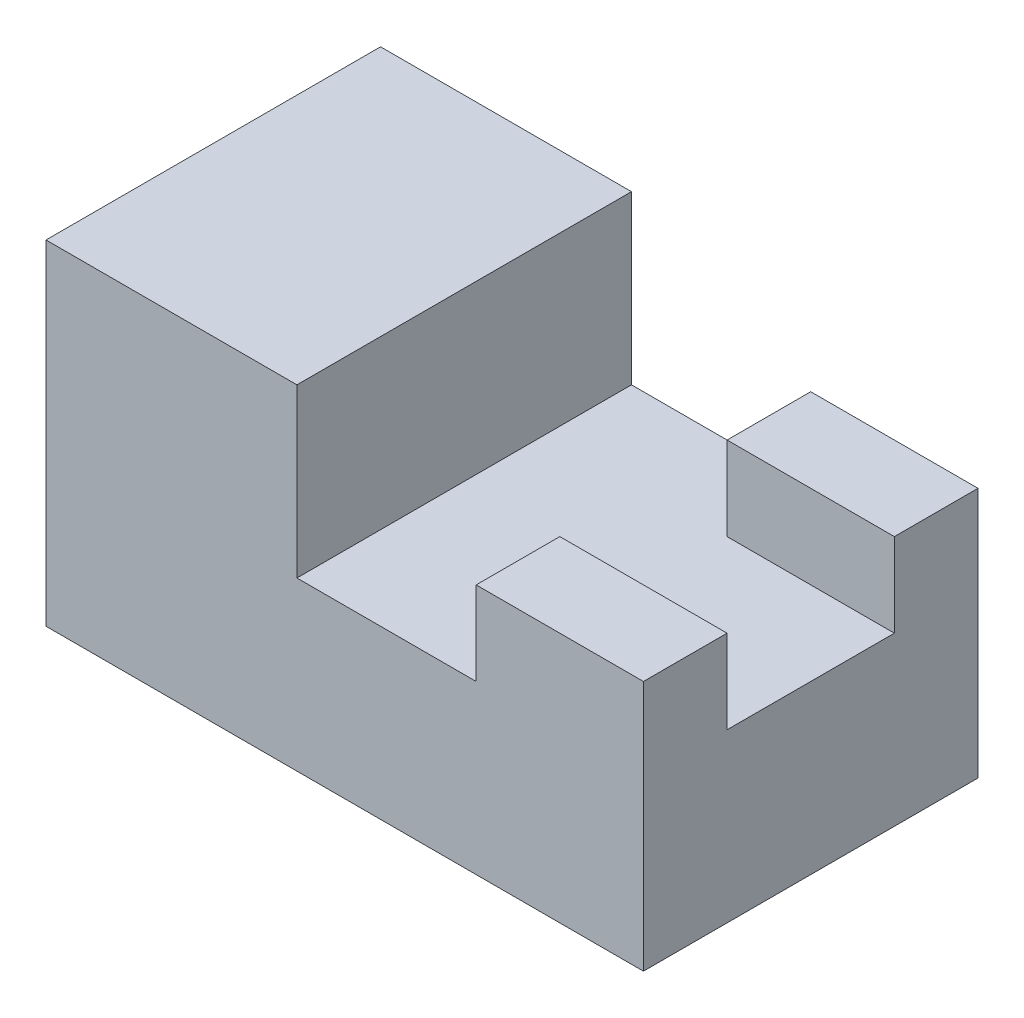
ISO-10303-21;
HEADER;
FILE_DESCRIPTION(('STEP AP214'),'2;1');
FILE_NAME('part.step','',(''),(''),'','','');
FILE_SCHEMA(('AUTOMOTIVE_DESIGN { 1 0 10303 214 1 1 1 1 }'));
ENDSEC;
DATA;
#1=APPLICATION_CONTEXT('core data for automotive mechanical design processes');
#2=APPLICATION_PROTOCOL_DEFINITION('international standard','automotive_design',2000,#1);
#3=PRODUCT_CONTEXT('',#1,'mechanical');
#4=PRODUCT('Part','Part','',(#3));
#5=PRODUCT_RELATED_PRODUCT_CATEGORY('part','',(#4));
#6=PRODUCT_DEFINITION_FORMATION('','',#4);
#7=PRODUCT_DEFINITION_CONTEXT('part definition',#1,'design');
#8=PRODUCT_DEFINITION('design','',#6,#7);
#9=PRODUCT_DEFINITION_SHAPE('','',#8);
#10=(LENGTH_UNIT() NAMED_UNIT(*) SI_UNIT(.MILLI.,.METRE.));
#11=(NAMED_UNIT(*) PLANE_ANGLE_UNIT() SI_UNIT($,.RADIAN.));
#12=(NAMED_UNIT(*) SI_UNIT($,.STERADIAN.) SOLID_ANGLE_UNIT());
#13=UNCERTAINTY_MEASURE_WITH_UNIT(LENGTH_MEASURE(1.E-05),#10,'distance_accuracy_value','');
#14=(GEOMETRIC_REPRESENTATION_CONTEXT(3) GLOBAL_UNCERTAINTY_ASSIGNED_CONTEXT((#13)) GLOBAL_UNIT_ASSIGNED_CONTEXT((#10,
#11,#12)) REPRESENTATION_CONTEXT('',''));
#15=CARTESIAN_POINT('',(0.,0.,0.));
#16=DIRECTION('',(0.,0.,1.));
#17=DIRECTION('',(1.,0.,0.));
#18=AXIS2_PLACEMENT_3D('',#15,#16,#17);
#19=CARTESIAN_POINT('',(25.,14.,0.));
#20=DIRECTION('',(1.,0.,0.));
#21=DIRECTION('',(0.,0.,-1.));
#22=AXIS2_PLACEMENT_3D('',#19,#20,#21);
#23=PLANE('',#22);
#24=DIRECTION('',(0.,0.,1.));
#25=VECTOR('',#24,1.);
#26=CARTESIAN_POINT('',(25.,0.,0.));
#27=LINE('',#26,#25);
#28=CARTESIAN_POINT('',(25.,0.,-14.));
#29=VERTEX_POINT('',#28);
#30=CARTESIAN_POINT('',(25.,0.,14.));
#31=VERTEX_POINT('',#30);
#32=EDGE_CURVE('E210',#29,#31,#27,.T.);
#33=ORIENTED_EDGE('',*,*,#32,.F.);
#34=DIRECTION('',(0.,-1.,0.));
#35=VECTOR('',#34,1.);
#36=CARTESIAN_POINT('',(25.,21.,-14.));
#37=LINE('',#36,#35);
#38=CARTESIAN_POINT('',(25.,21.,-14.));
#39=VERTEX_POINT('',#38);
#40=EDGE_CURVE('E162',#39,#29,#37,.T.);
#41=ORIENTED_EDGE('',*,*,#40,.F.);
#42=DIRECTION('',(0.,0.,1.));
#43=VECTOR('',#42,1.);
#44=CARTESIAN_POINT('',(25.,21.,0.));
#45=LINE('',#44,#43);
#46=CARTESIAN_POINT('',(25.,21.,-7.));
#47=VERTEX_POINT('',#46);
#48=EDGE_CURVE('E157',#39,#47,#45,.T.);
#49=ORIENTED_EDGE('',*,*,#48,.T.);
#50=DIRECTION('',(0.,-1.,0.));
#51=VECTOR('',#50,1.);
#52=CARTESIAN_POINT('',(25.,21.,-7.));
#53=LINE('',#52,#51);
#54=CARTESIAN_POINT('',(25.,14.,-7.));
#55=VERTEX_POINT('',#54);
#56=EDGE_CURVE('E164',#47,#55,#53,.T.);
#57=ORIENTED_EDGE('',*,*,#56,.T.);
#58=DIRECTION('',(0.,0.,1.));
#59=VECTOR('',#58,1.);
#60=CARTESIAN_POINT('',(25.,14.,0.));
#61=LINE('',#60,#59);
#62=CARTESIAN_POINT('',(25.,14.,7.));
#63=VERTEX_POINT('',#62);
#64=EDGE_CURVE('E215',#55,#63,#61,.T.);
#65=ORIENTED_EDGE('',*,*,#64,.T.);
#66=DIRECTION('',(0.,-1.,0.));
#67=VECTOR('',#66,1.);
#68=CARTESIAN_POINT('',(25.,21.,7.));
#69=LINE('',#68,#67);
#70=CARTESIAN_POINT('',(25.,21.,7.));
#71=VERTEX_POINT('',#70);
#72=EDGE_CURVE('E177',#71,#63,#69,.T.);
#73=ORIENTED_EDGE('',*,*,#72,.F.);
#74=DIRECTION('',(0.,0.,1.));
#75=VECTOR('',#74,1.);
#76=CARTESIAN_POINT('',(25.,21.,0.));
#77=LINE('',#76,#75);
#78=CARTESIAN_POINT('',(25.,21.,14.));
#79=VERTEX_POINT('',#78);
#80=EDGE_CURVE('E174',#71,#79,#77,.T.);
#81=ORIENTED_EDGE('',*,*,#80,.T.);
#82=DIRECTION('',(0.,-1.,0.));
#83=VECTOR('',#82,1.);
#84=CARTESIAN_POINT('',(25.,21.,14.));
#85=LINE('',#84,#83);
#86=EDGE_CURVE('E179',#79,#31,#85,.T.);
#87=ORIENTED_EDGE('',*,*,#86,.T.);
#88=EDGE_LOOP('',(#33,#41,#49,#57,#65,#73,#81,#87));
#89=FACE_BOUND('',#88,.T.);
#90=ADVANCED_FACE('F41',(#89),#23,.T.);
#91=CARTESIAN_POINT('',(0.,14.,-14.));
#92=DIRECTION('',(0.,0.,-1.));
#93=DIRECTION('',(-1.,0.,0.));
#94=AXIS2_PLACEMENT_3D('',#91,#92,#93);
#95=PLANE('',#94);
#96=DIRECTION('',(1.,0.,0.));
#97=VECTOR('',#96,1.);
#98=CARTESIAN_POINT('',(0.,0.,-14.));
#99=LINE('',#98,#97);
#100=CARTESIAN_POINT('',(-25.,0.,-14.));
#101=VERTEX_POINT('',#100);
#102=EDGE_CURVE('E223',#101,#29,#99,.T.);
#103=ORIENTED_EDGE('',*,*,#102,.F.);
#104=DIRECTION('',(0.,-1.,0.));
#105=VECTOR('',#104,1.);
#106=CARTESIAN_POINT('',(-25.,28.,-14.));
#107=LINE('',#106,#105);
#108=CARTESIAN_POINT('',(-25.,28.,-14.));
#109=VERTEX_POINT('',#108);
#110=EDGE_CURVE('E199',#109,#101,#107,.T.);
#111=ORIENTED_EDGE('',*,*,#110,.F.);
#112=DIRECTION('',(1.,0.,0.));
#113=VECTOR('',#112,1.);
#114=CARTESIAN_POINT('',(0.,28.,-14.));
#115=LINE('',#114,#113);
#116=CARTESIAN_POINT('',(-4.,28.,-14.));
#117=VERTEX_POINT('',#116);
#118=EDGE_CURVE('E196',#109,#117,#115,.T.);
#119=ORIENTED_EDGE('',*,*,#118,.T.);
#120=DIRECTION('',(0.,-1.,0.));
#121=VECTOR('',#120,1.);
#122=CARTESIAN_POINT('',(-4.,28.,-14.));
#123=LINE('',#122,#121);
#124=CARTESIAN_POINT('',(-4.,14.,-14.));
#125=VERTEX_POINT('',#124);
#126=EDGE_CURVE('E204',#117,#125,#123,.T.);
#127=ORIENTED_EDGE('',*,*,#126,.T.);
#128=DIRECTION('',(1.,0.,0.));
#129=VECTOR('',#128,1.);
#130=CARTESIAN_POINT('',(0.,14.,-14.));
#131=LINE('',#130,#129);
#132=CARTESIAN_POINT('',(11.,14.,-14.));
#133=VERTEX_POINT('',#132);
#134=EDGE_CURVE('E141',#125,#133,#131,.T.);
#135=ORIENTED_EDGE('',*,*,#134,.T.);
#136=DIRECTION('',(0.,-1.,0.));
#137=VECTOR('',#136,1.);
#138=CARTESIAN_POINT('',(11.,21.,-14.));
#139=LINE('',#138,#137);
#140=CARTESIAN_POINT('',(11.,21.,-14.));
#141=VERTEX_POINT('',#140);
#142=EDGE_CURVE('E133',#141,#133,#139,.T.);
#143=ORIENTED_EDGE('',*,*,#142,.F.);
#144=DIRECTION('',(1.,0.,0.));
#145=VECTOR('',#144,1.);
#146=CARTESIAN_POINT('',(0.,21.,-14.));
#147=LINE('',#146,#145);
#148=EDGE_CURVE('E138',#141,#39,#147,.T.);
#149=ORIENTED_EDGE('',*,*,#148,.T.);
#150=ORIENTED_EDGE('',*,*,#40,.T.);
#151=EDGE_LOOP('',(#103,#111,#119,#127,#135,#143,#149,#150));
#152=FACE_BOUND('',#151,.T.);
#153=ADVANCED_FACE('F135',(#152),#95,.T.);
#154=CARTESIAN_POINT('',(0.,14.,14.));
#155=DIRECTION('',(0.,0.,-1.));
#156=DIRECTION('',(-1.,0.,0.));
#157=AXIS2_PLACEMENT_3D('',#154,#155,#156);
#158=PLANE('',#157);
#159=DIRECTION('',(1.,0.,0.));
#160=VECTOR('',#159,1.);
#161=CARTESIAN_POINT('',(0.,0.,14.));
#162=LINE('',#161,#160);
#163=CARTESIAN_POINT('',(-25.,0.,14.));
#164=VERTEX_POINT('',#163);
#165=EDGE_CURVE('E44',#164,#31,#162,.T.);
#166=ORIENTED_EDGE('',*,*,#165,.T.);
#167=ORIENTED_EDGE('',*,*,#86,.F.);
#168=DIRECTION('',(1.,0.,0.));
#169=VECTOR('',#168,1.);
#170=CARTESIAN_POINT('',(0.,21.,14.));
#171=LINE('',#170,#169);
#172=CARTESIAN_POINT('',(11.,21.,14.));
#173=VERTEX_POINT('',#172);
#174=EDGE_CURVE('E172',#173,#79,#171,.T.);
#175=ORIENTED_EDGE('',*,*,#174,.F.);
#176=DIRECTION('',(0.,-1.,0.));
#177=VECTOR('',#176,1.);
#178=CARTESIAN_POINT('',(11.,21.,14.));
#179=LINE('',#178,#177);
#180=CARTESIAN_POINT('',(11.,14.,14.));
#181=VERTEX_POINT('',#180);
#182=EDGE_CURVE('E182',#173,#181,#179,.T.);
#183=ORIENTED_EDGE('',*,*,#182,.T.);
#184=DIRECTION('',(1.,0.,0.));
#185=VECTOR('',#184,1.);
#186=CARTESIAN_POINT('',(0.,14.,14.));
#187=LINE('',#186,#185);
#188=CARTESIAN_POINT('',(-4.,14.,14.));
#189=VERTEX_POINT('',#188);
#190=EDGE_CURVE('E11',#189,#181,#187,.T.);
#191=ORIENTED_EDGE('',*,*,#190,.F.);
#192=DIRECTION('',(0.,-1.,0.));
#193=VECTOR('',#192,1.);
#194=CARTESIAN_POINT('',(-4.,28.,14.));
#195=LINE('',#194,#193);
#196=CARTESIAN_POINT('',(-4.,28.,14.));
#197=VERTEX_POINT('',#196);
#198=EDGE_CURVE('E57',#197,#189,#195,.T.);
#199=ORIENTED_EDGE('',*,*,#198,.F.);
#200=DIRECTION('',(1.,0.,0.));
#201=VECTOR('',#200,1.);
#202=CARTESIAN_POINT('',(0.,28.,14.));
#203=LINE('',#202,#201);
#204=CARTESIAN_POINT('',(-25.,28.,14.));
#205=VERTEX_POINT('',#204);
#206=EDGE_CURVE('E192',#205,#197,#203,.T.);
#207=ORIENTED_EDGE('',*,*,#206,.F.);
#208=DIRECTION('',(0.,-1.,0.));
#209=VECTOR('',#208,1.);
#210=CARTESIAN_POINT('',(-25.,28.,14.));
#211=LINE('',#210,#209);
#212=EDGE_CURVE('E207',#205,#164,#211,.T.);
#213=ORIENTED_EDGE('',*,*,#212,.T.);
#214=EDGE_LOOP('',(#166,#167,#175,#183,#191,#199,#207,#213));
#215=FACE_BOUND('',#214,.T.);
#216=ADVANCED_FACE('F230',(#215),#158,.F.);
#217=CARTESIAN_POINT('',(0.,14.,0.));
#218=DIRECTION('',(0.,1.,0.));
#219=DIRECTION('',(0.,0.,1.));
#220=AXIS2_PLACEMENT_3D('',#217,#218,#219);
#221=PLANE('',#220);
#222=DIRECTION('',(0.,0.,1.));
#223=VECTOR('',#222,1.);
#224=CARTESIAN_POINT('',(11.,14.,0.));
#225=LINE('',#224,#223);
#226=CARTESIAN_POINT('',(11.,14.,7.));
#227=VERTEX_POINT('',#226);
#228=EDGE_CURVE('E211',#227,#181,#225,.T.);
#229=ORIENTED_EDGE('',*,*,#228,.F.);
#230=DIRECTION('',(-1.,0.,0.));
#231=VECTOR('',#230,1.);
#232=CARTESIAN_POINT('',(0.,14.,7.));
#233=LINE('',#232,#231);
#234=EDGE_CURVE('E213',#63,#227,#233,.T.);
#235=ORIENTED_EDGE('',*,*,#234,.F.);
#236=ORIENTED_EDGE('',*,*,#64,.F.);
#237=DIRECTION('',(-1.,0.,0.));
#238=VECTOR('',#237,1.);
#239=CARTESIAN_POINT('',(0.,14.,-7.));
#240=LINE('',#239,#238);
#241=CARTESIAN_POINT('',(11.,14.,-7.));
#242=VERTEX_POINT('',#241);
#243=EDGE_CURVE('E218',#55,#242,#240,.T.);
#244=ORIENTED_EDGE('',*,*,#243,.T.);
#245=DIRECTION('',(0.,0.,1.));
#246=VECTOR('',#245,1.);
#247=CARTESIAN_POINT('',(11.,14.,0.));
#248=LINE('',#247,#246);
#249=EDGE_CURVE('E65',#133,#242,#248,.T.);
#250=ORIENTED_EDGE('',*,*,#249,.F.);
#251=ORIENTED_EDGE('',*,*,#134,.F.);
#252=DIRECTION('',(0.,0.,1.));
#253=VECTOR('',#252,1.);
#254=CARTESIAN_POINT('',(-4.,14.,0.));
#255=LINE('',#254,#253);
#256=EDGE_CURVE('E49',#125,#189,#255,.T.);
#257=ORIENTED_EDGE('',*,*,#256,.T.);
#258=ORIENTED_EDGE('',*,*,#190,.T.);
#259=EDGE_LOOP('',(#229,#235,#236,#244,#250,#251,#257,#258));
#260=FACE_BOUND('',#259,.T.);
#261=ADVANCED_FACE('F243',(#260),#221,.T.);
#262=CARTESIAN_POINT('',(0.,0.,0.));
#263=DIRECTION('',(0.,1.,0.));
#264=DIRECTION('',(0.,0.,1.));
#265=AXIS2_PLACEMENT_3D('',#262,#263,#264);
#266=PLANE('',#265);
#267=ORIENTED_EDGE('',*,*,#32,.T.);
#268=ORIENTED_EDGE('',*,*,#165,.F.);
#269=DIRECTION('',(0.,0.,1.));
#270=VECTOR('',#269,1.);
#271=CARTESIAN_POINT('',(-25.,0.,0.));
#272=LINE('',#271,#270);
#273=EDGE_CURVE('E188',#101,#164,#272,.T.);
#274=ORIENTED_EDGE('',*,*,#273,.F.);
#275=ORIENTED_EDGE('',*,*,#102,.T.);
#276=EDGE_LOOP('',(#267,#268,#274,#275));
#277=FACE_BOUND('',#276,.T.);
#278=ADVANCED_FACE('F253',(#277),#266,.F.);
#279=CARTESIAN_POINT('',(-4.,28.,0.));
#280=DIRECTION('',(1.,0.,0.));
#281=DIRECTION('',(0.,0.,-1.));
#282=AXIS2_PLACEMENT_3D('',#279,#280,#281);
#283=PLANE('',#282);
#284=ORIENTED_EDGE('',*,*,#256,.F.);
#285=ORIENTED_EDGE('',*,*,#126,.F.);
#286=DIRECTION('',(0.,0.,1.));
#287=VECTOR('',#286,1.);
#288=CARTESIAN_POINT('',(-4.,28.,0.));
#289=LINE('',#288,#287);
#290=EDGE_CURVE('E194',#117,#197,#289,.T.);
#291=ORIENTED_EDGE('',*,*,#290,.T.);
#292=ORIENTED_EDGE('',*,*,#198,.T.);
#293=EDGE_LOOP('',(#284,#285,#291,#292));
#294=FACE_BOUND('',#293,.T.);
#295=ADVANCED_FACE('F245',(#294),#283,.T.);
#296=CARTESIAN_POINT('',(-25.,28.,0.));
#297=DIRECTION('',(1.,0.,0.));
#298=DIRECTION('',(0.,0.,-1.));
#299=AXIS2_PLACEMENT_3D('',#296,#297,#298);
#300=PLANE('',#299);
#301=ORIENTED_EDGE('',*,*,#273,.T.);
#302=ORIENTED_EDGE('',*,*,#212,.F.);
#303=DIRECTION('',(0.,0.,1.));
#304=VECTOR('',#303,1.);
#305=CARTESIAN_POINT('',(-25.,28.,0.));
#306=LINE('',#305,#304);
#307=EDGE_CURVE('E189',#109,#205,#306,.T.);
#308=ORIENTED_EDGE('',*,*,#307,.F.);
#309=ORIENTED_EDGE('',*,*,#110,.T.);
#310=EDGE_LOOP('',(#301,#302,#308,#309));
#311=FACE_BOUND('',#310,.T.);
#312=ADVANCED_FACE('F252',(#311),#300,.F.);
#313=CARTESIAN_POINT('',(0.,28.,0.));
#314=DIRECTION('',(0.,1.,0.));
#315=DIRECTION('',(0.,0.,1.));
#316=AXIS2_PLACEMENT_3D('',#313,#314,#315);
#317=PLANE('',#316);
#318=ORIENTED_EDGE('',*,*,#307,.T.);
#319=ORIENTED_EDGE('',*,*,#206,.T.);
#320=ORIENTED_EDGE('',*,*,#290,.F.);
#321=ORIENTED_EDGE('',*,*,#118,.F.);
#322=EDGE_LOOP('',(#318,#319,#320,#321));
#323=FACE_BOUND('',#322,.T.);
#324=ADVANCED_FACE('F250',(#323),#317,.T.);
#325=CARTESIAN_POINT('',(0.,21.,7.));
#326=DIRECTION('',(0.,0.,1.));
#327=DIRECTION('',(1.,0.,0.));
#328=AXIS2_PLACEMENT_3D('',#325,#326,#327);
#329=PLANE('',#328);
#330=ORIENTED_EDGE('',*,*,#234,.T.);
#331=DIRECTION('',(0.,-1.,0.));
#332=VECTOR('',#331,1.);
#333=CARTESIAN_POINT('',(11.,21.,7.));
#334=LINE('',#333,#332);
#335=CARTESIAN_POINT('',(11.,21.,7.));
#336=VERTEX_POINT('',#335);
#337=EDGE_CURVE('E185',#336,#227,#334,.T.);
#338=ORIENTED_EDGE('',*,*,#337,.F.);
#339=DIRECTION('',(-1.,0.,0.));
#340=VECTOR('',#339,1.);
#341=CARTESIAN_POINT('',(0.,21.,7.));
#342=LINE('',#341,#340);
#343=EDGE_CURVE('E143',#71,#336,#342,.T.);
#344=ORIENTED_EDGE('',*,*,#343,.F.);
#345=ORIENTED_EDGE('',*,*,#72,.T.);
#346=EDGE_LOOP('',(#330,#338,#344,#345));
#347=FACE_BOUND('',#346,.T.);
#348=ADVANCED_FACE('F335',(#347),#329,.F.);
#349=CARTESIAN_POINT('',(11.,21.,0.));
#350=DIRECTION('',(1.,0.,0.));
#351=DIRECTION('',(0.,0.,-1.));
#352=AXIS2_PLACEMENT_3D('',#349,#350,#351);
#353=PLANE('',#352);
#354=ORIENTED_EDGE('',*,*,#228,.T.);
#355=ORIENTED_EDGE('',*,*,#182,.F.);
#356=DIRECTION('',(0.,0.,1.));
#357=VECTOR('',#356,1.);
#358=CARTESIAN_POINT('',(11.,21.,0.));
#359=LINE('',#358,#357);
#360=EDGE_CURVE('E170',#336,#173,#359,.T.);
#361=ORIENTED_EDGE('',*,*,#360,.F.);
#362=ORIENTED_EDGE('',*,*,#337,.T.);
#363=EDGE_LOOP('',(#354,#355,#361,#362));
#364=FACE_BOUND('',#363,.T.);
#365=ADVANCED_FACE('F353',(#364),#353,.F.);
#366=CARTESIAN_POINT('',(0.,21.,0.));
#367=DIRECTION('',(0.,1.,0.));
#368=DIRECTION('',(0.,0.,1.));
#369=AXIS2_PLACEMENT_3D('',#366,#367,#368);
#370=PLANE('',#369);
#371=ORIENTED_EDGE('',*,*,#343,.T.);
#372=ORIENTED_EDGE('',*,*,#360,.T.);
#373=ORIENTED_EDGE('',*,*,#174,.T.);
#374=ORIENTED_EDGE('',*,*,#80,.F.);
#375=EDGE_LOOP('',(#371,#372,#373,#374));
#376=FACE_BOUND('',#375,.T.);
#377=ADVANCED_FACE('F237',(#376),#370,.T.);
#378=CARTESIAN_POINT('',(11.,21.,0.));
#379=DIRECTION('',(1.,0.,0.));
#380=DIRECTION('',(0.,0.,-1.));
#381=AXIS2_PLACEMENT_3D('',#378,#379,#380);
#382=PLANE('',#381);
#383=ORIENTED_EDGE('',*,*,#249,.T.);
#384=DIRECTION('',(0.,-1.,0.));
#385=VECTOR('',#384,1.);
#386=CARTESIAN_POINT('',(11.,21.,-7.));
#387=LINE('',#386,#385);
#388=CARTESIAN_POINT('',(11.,21.,-7.));
#389=VERTEX_POINT('',#388);
#390=EDGE_CURVE('E144',#389,#242,#387,.T.);
#391=ORIENTED_EDGE('',*,*,#390,.F.);
#392=DIRECTION('',(0.,0.,1.));
#393=VECTOR('',#392,1.);
#394=CARTESIAN_POINT('',(11.,21.,0.));
#395=LINE('',#394,#393);
#396=EDGE_CURVE('E147',#141,#389,#395,.T.);
#397=ORIENTED_EDGE('',*,*,#396,.F.);
#398=ORIENTED_EDGE('',*,*,#142,.T.);
#399=EDGE_LOOP('',(#383,#391,#397,#398));
#400=FACE_BOUND('',#399,.T.);
#401=ADVANCED_FACE('F148',(#400),#382,.F.);
#402=CARTESIAN_POINT('',(0.,21.,-7.));
#403=DIRECTION('',(0.,0.,1.));
#404=DIRECTION('',(1.,0.,0.));
#405=AXIS2_PLACEMENT_3D('',#402,#403,#404);
#406=PLANE('',#405);
#407=ORIENTED_EDGE('',*,*,#390,.T.);
#408=ORIENTED_EDGE('',*,*,#243,.F.);
#409=ORIENTED_EDGE('',*,*,#56,.F.);
#410=DIRECTION('',(-1.,0.,0.));
#411=VECTOR('',#410,1.);
#412=CARTESIAN_POINT('',(0.,21.,-7.));
#413=LINE('',#412,#411);
#414=EDGE_CURVE('E153',#47,#389,#413,.T.);
#415=ORIENTED_EDGE('',*,*,#414,.T.);
#416=EDGE_LOOP('',(#407,#408,#409,#415));
#417=FACE_BOUND('',#416,.T.);
#418=ADVANCED_FACE('F361',(#417),#406,.T.);
#419=CARTESIAN_POINT('',(0.,21.,0.));
#420=DIRECTION('',(0.,1.,0.));
#421=DIRECTION('',(0.,0.,1.));
#422=AXIS2_PLACEMENT_3D('',#419,#420,#421);
#423=PLANE('',#422);
#424=ORIENTED_EDGE('',*,*,#148,.F.);
#425=ORIENTED_EDGE('',*,*,#396,.T.);
#426=ORIENTED_EDGE('',*,*,#414,.F.);
#427=ORIENTED_EDGE('',*,*,#48,.F.);
#428=EDGE_LOOP('',(#424,#425,#426,#427));
#429=FACE_BOUND('',#428,.T.);
#430=ADVANCED_FACE('F155',(#429),#423,.T.);
#431=CLOSED_SHELL('',(#90,#153,#216,#261,#278,#295,#312,#324,#348,#365,#377,#401,#418,#430));
#432=MANIFOLD_SOLID_BREP('B2',#431);
#433=ADVANCED_BREP_SHAPE_REPRESENTATION('',(#18,#432),#14);
#434=SHAPE_DEFINITION_REPRESENTATION(#9,#433);
ENDSEC;
END-ISO-10303-21;
